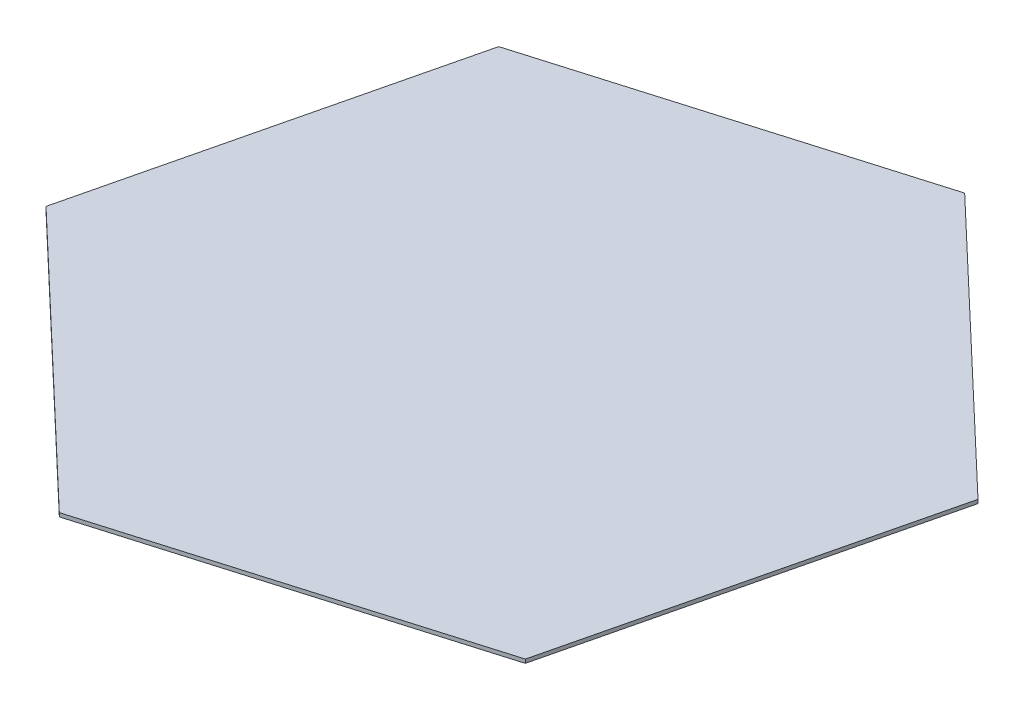
ISO-10303-21;
HEADER;
FILE_DESCRIPTION(('STEP AP214'),'2;1');
FILE_NAME('part.step','',(''),(''),'','','');
FILE_SCHEMA(('AUTOMOTIVE_DESIGN { 1 0 10303 214 1 1 1 1 }'));
ENDSEC;
DATA;
#1=APPLICATION_CONTEXT('core data for automotive mechanical design processes');
#2=APPLICATION_PROTOCOL_DEFINITION('international standard','automotive_design',2000,#1);
#3=PRODUCT_CONTEXT('',#1,'mechanical');
#4=PRODUCT('Part','Part','',(#3));
#5=PRODUCT_RELATED_PRODUCT_CATEGORY('part','',(#4));
#6=PRODUCT_DEFINITION_FORMATION('','',#4);
#7=PRODUCT_DEFINITION_CONTEXT('part definition',#1,'design');
#8=PRODUCT_DEFINITION('design','',#6,#7);
#9=PRODUCT_DEFINITION_SHAPE('','',#8);
#10=(LENGTH_UNIT() NAMED_UNIT(*) SI_UNIT(.MILLI.,.METRE.));
#11=(NAMED_UNIT(*) PLANE_ANGLE_UNIT() SI_UNIT($,.RADIAN.));
#12=(NAMED_UNIT(*) SI_UNIT($,.STERADIAN.) SOLID_ANGLE_UNIT());
#13=UNCERTAINTY_MEASURE_WITH_UNIT(LENGTH_MEASURE(1.E-05),#10,'distance_accuracy_value','');
#14=(GEOMETRIC_REPRESENTATION_CONTEXT(3) GLOBAL_UNCERTAINTY_ASSIGNED_CONTEXT((#13)) GLOBAL_UNIT_ASSIGNED_CONTEXT((#10,
#11,#12)) REPRESENTATION_CONTEXT('',''));
#15=CARTESIAN_POINT('',(0.,0.,0.));
#16=DIRECTION('',(0.,0.,1.));
#17=DIRECTION('',(1.,0.,0.));
#18=AXIS2_PLACEMENT_3D('',#15,#16,#17);
#19=CARTESIAN_POINT('',(-191.823582954893,2.,56.601351771379));
#20=DIRECTION('',(0.689117099990996,0.,-0.72465));
#21=DIRECTION('',(-0.72465,0.,-0.689117099990996));
#22=AXIS2_PLACEMENT_3D('',#19,#20,#21);
#23=PLANE('',#22);
#24=DIRECTION('',(0.72465,0.,0.689117099990996));
#25=VECTOR('',#24,1.);
#26=CARTESIAN_POINT('',(-191.823582954893,0.,56.601351771379));
#27=LINE('',#26,#25);
#28=CARTESIAN_POINT('',(-191.823582954893,0.,56.601351771379));
#29=VERTEX_POINT('',#28);
#30=CARTESIAN_POINT('',(-46.8935829548927,0.,194.424771769578));
#31=VERTEX_POINT('',#30);
#32=EDGE_CURVE('E128',#29,#31,#27,.T.);
#33=ORIENTED_EDGE('',*,*,#32,.T.);
#34=DIRECTION('',(0.,-1.,0.));
#35=VECTOR('',#34,1.);
#36=CARTESIAN_POINT('',(-46.8935829548927,2.,194.424771769578));
#37=LINE('',#36,#35);
#38=CARTESIAN_POINT('',(-46.8935829548927,2.,194.424771769578));
#39=VERTEX_POINT('',#38);
#40=EDGE_CURVE('E11',#39,#31,#37,.T.);
#41=ORIENTED_EDGE('',*,*,#40,.F.);
#42=DIRECTION('',(0.72465,0.,0.689117099990996));
#43=VECTOR('',#42,1.);
#44=CARTESIAN_POINT('',(-191.823582954893,2.,56.601351771379));
#45=LINE('',#44,#43);
#46=CARTESIAN_POINT('',(-191.823582954893,2.,56.601351771379));
#47=VERTEX_POINT('',#46);
#48=EDGE_CURVE('E144',#47,#39,#45,.T.);
#49=ORIENTED_EDGE('',*,*,#48,.F.);
#50=DIRECTION('',(0.,-1.,0.));
#51=VECTOR('',#50,1.);
#52=CARTESIAN_POINT('',(-191.823582954893,2.,56.601351771379));
#53=LINE('',#52,#51);
#54=EDGE_CURVE('E124',#47,#29,#53,.T.);
#55=ORIENTED_EDGE('',*,*,#54,.T.);
#56=EDGE_LOOP('',(#33,#41,#49,#55));
#57=FACE_BOUND('',#56,.T.);
#58=ADVANCED_FACE('F39',(#57),#23,.F.);
#59=CARTESIAN_POINT('',(-46.8935829548927,2.,194.424771769578));
#60=DIRECTION('',(-0.283006758856896,0.,-0.959117914774463));
#61=DIRECTION('',(-0.959117914774463,0.,0.283006758856896));
#62=AXIS2_PLACEMENT_3D('',#59,#60,#61);
#63=PLANE('',#62);
#64=DIRECTION('',(0.959117914774463,0.,-0.283006758856896));
#65=VECTOR('',#64,1.);
#66=CARTESIAN_POINT('',(-46.8935829548927,0.,194.424771769578));
#67=LINE('',#66,#65);
#68=CARTESIAN_POINT('',(144.93,0.,137.823419998199));
#69=VERTEX_POINT('',#68);
#70=EDGE_CURVE('E132',#31,#69,#67,.T.);
#71=ORIENTED_EDGE('',*,*,#70,.T.);
#72=DIRECTION('',(0.,-1.,0.));
#73=VECTOR('',#72,1.);
#74=CARTESIAN_POINT('',(144.93,2.,137.823419998199));
#75=LINE('',#74,#73);
#76=CARTESIAN_POINT('',(144.93,2.,137.823419998199));
#77=VERTEX_POINT('',#76);
#78=EDGE_CURVE('E48',#77,#69,#75,.T.);
#79=ORIENTED_EDGE('',*,*,#78,.F.);
#80=DIRECTION('',(0.959117914774463,0.,-0.283006758856896));
#81=VECTOR('',#80,1.);
#82=CARTESIAN_POINT('',(-46.8935829548927,2.,194.424771769578));
#83=LINE('',#82,#81);
#84=EDGE_CURVE('E93',#39,#77,#83,.T.);
#85=ORIENTED_EDGE('',*,*,#84,.F.);
#86=ORIENTED_EDGE('',*,*,#40,.T.);
#87=EDGE_LOOP('',(#71,#79,#85,#86));
#88=FACE_BOUND('',#87,.T.);
#89=ADVANCED_FACE('F172',(#88),#63,.F.);
#90=CARTESIAN_POINT('',(144.93,2.,137.823419998199));
#91=DIRECTION('',(-0.972123858847891,0.,-0.234467914774464));
#92=DIRECTION('',(-0.234467914774464,0.,0.972123858847891));
#93=AXIS2_PLACEMENT_3D('',#90,#91,#92);
#94=PLANE('',#93);
#95=DIRECTION('',(0.234467914774464,0.,-0.972123858847891));
#96=VECTOR('',#95,1.);
#97=CARTESIAN_POINT('',(144.93,0.,137.823419998199));
#98=LINE('',#97,#96);
#99=CARTESIAN_POINT('',(191.823582954893,0.,-56.6013517713791));
#100=VERTEX_POINT('',#99);
#101=EDGE_CURVE('E135',#69,#100,#98,.T.);
#102=ORIENTED_EDGE('',*,*,#101,.T.);
#103=DIRECTION('',(0.,-1.,0.));
#104=VECTOR('',#103,1.);
#105=CARTESIAN_POINT('',(191.823582954893,2.,-56.6013517713791));
#106=LINE('',#105,#104);
#107=CARTESIAN_POINT('',(191.823582954893,2.,-56.6013517713791));
#108=VERTEX_POINT('',#107);
#109=EDGE_CURVE('E117',#108,#100,#106,.T.);
#110=ORIENTED_EDGE('',*,*,#109,.F.);
#111=DIRECTION('',(0.234467914774464,0.,-0.972123858847891));
#112=VECTOR('',#111,1.);
#113=CARTESIAN_POINT('',(144.93,2.,137.823419998199));
#114=LINE('',#113,#112);
#115=EDGE_CURVE('E106',#77,#108,#114,.T.);
#116=ORIENTED_EDGE('',*,*,#115,.F.);
#117=ORIENTED_EDGE('',*,*,#78,.T.);
#118=EDGE_LOOP('',(#102,#110,#116,#117));
#119=FACE_BOUND('',#118,.T.);
#120=ADVANCED_FACE('F154',(#119),#94,.F.);
#121=CARTESIAN_POINT('',(191.823582954893,2.,-56.6013517713791));
#122=DIRECTION('',(-0.689117099990996,0.,0.72465));
#123=DIRECTION('',(0.72465,0.,0.689117099990996));
#124=AXIS2_PLACEMENT_3D('',#121,#122,#123);
#125=PLANE('',#124);
#126=DIRECTION('',(-0.72465,0.,-0.689117099990996));
#127=VECTOR('',#126,1.);
#128=CARTESIAN_POINT('',(191.823582954893,0.,-56.6013517713791));
#129=LINE('',#128,#127);
#130=CARTESIAN_POINT('',(46.8935829548927,0.,-194.424771769578));
#131=VERTEX_POINT('',#130);
#132=EDGE_CURVE('E115',#100,#131,#129,.T.);
#133=ORIENTED_EDGE('',*,*,#132,.T.);
#134=DIRECTION('',(0.,-1.,0.));
#135=VECTOR('',#134,1.);
#136=CARTESIAN_POINT('',(46.8935829548927,2.,-194.424771769578));
#137=LINE('',#136,#135);
#138=CARTESIAN_POINT('',(46.8935829548927,2.,-194.424771769578));
#139=VERTEX_POINT('',#138);
#140=EDGE_CURVE('E112',#139,#131,#137,.T.);
#141=ORIENTED_EDGE('',*,*,#140,.F.);
#142=DIRECTION('',(-0.72465,0.,-0.689117099990996));
#143=VECTOR('',#142,1.);
#144=CARTESIAN_POINT('',(191.823582954893,2.,-56.6013517713791));
#145=LINE('',#144,#143);
#146=EDGE_CURVE('E100',#108,#139,#145,.T.);
#147=ORIENTED_EDGE('',*,*,#146,.F.);
#148=ORIENTED_EDGE('',*,*,#109,.T.);
#149=EDGE_LOOP('',(#133,#141,#147,#148));
#150=FACE_BOUND('',#149,.T.);
#151=ADVANCED_FACE('F113',(#150),#125,.F.);
#152=CARTESIAN_POINT('',(46.8935829548927,2.,-194.424771769578));
#153=DIRECTION('',(0.283006758856896,0.,0.959117914774463));
#154=DIRECTION('',(0.959117914774463,0.,-0.283006758856896));
#155=AXIS2_PLACEMENT_3D('',#152,#153,#154);
#156=PLANE('',#155);
#157=DIRECTION('',(-0.959117914774463,0.,0.283006758856896));
#158=VECTOR('',#157,1.);
#159=CARTESIAN_POINT('',(46.8935829548927,0.,-194.424771769578));
#160=LINE('',#159,#158);
#161=CARTESIAN_POINT('',(-144.93,0.,-137.823419998199));
#162=VERTEX_POINT('',#161);
#163=EDGE_CURVE('E79',#131,#162,#160,.T.);
#164=ORIENTED_EDGE('',*,*,#163,.T.);
#165=DIRECTION('',(0.,-1.,0.));
#166=VECTOR('',#165,1.);
#167=CARTESIAN_POINT('',(-144.93,2.,-137.823419998199));
#168=LINE('',#167,#166);
#169=CARTESIAN_POINT('',(-144.93,2.,-137.823419998199));
#170=VERTEX_POINT('',#169);
#171=EDGE_CURVE('E118',#170,#162,#168,.T.);
#172=ORIENTED_EDGE('',*,*,#171,.F.);
#173=DIRECTION('',(-0.959117914774463,0.,0.283006758856896));
#174=VECTOR('',#173,1.);
#175=CARTESIAN_POINT('',(46.8935829548927,2.,-194.424771769578));
#176=LINE('',#175,#174);
#177=EDGE_CURVE('E104',#139,#170,#176,.T.);
#178=ORIENTED_EDGE('',*,*,#177,.F.);
#179=ORIENTED_EDGE('',*,*,#140,.T.);
#180=EDGE_LOOP('',(#164,#172,#178,#179));
#181=FACE_BOUND('',#180,.T.);
#182=ADVANCED_FACE('F120',(#181),#156,.F.);
#183=CARTESIAN_POINT('',(-144.93,2.,-137.823419998199));
#184=DIRECTION('',(0.972123858847891,0.,0.234467914774464));
#185=DIRECTION('',(0.234467914774464,0.,-0.972123858847891));
#186=AXIS2_PLACEMENT_3D('',#183,#184,#185);
#187=PLANE('',#186);
#188=DIRECTION('',(-0.234467914774464,0.,0.972123858847891));
#189=VECTOR('',#188,1.);
#190=CARTESIAN_POINT('',(-144.93,0.,-137.823419998199));
#191=LINE('',#190,#189);
#192=EDGE_CURVE('E85',#162,#29,#191,.T.);
#193=ORIENTED_EDGE('',*,*,#192,.T.);
#194=ORIENTED_EDGE('',*,*,#54,.F.);
#195=DIRECTION('',(-0.234467914774464,0.,0.972123858847891));
#196=VECTOR('',#195,1.);
#197=CARTESIAN_POINT('',(-144.93,2.,-137.823419998199));
#198=LINE('',#197,#196);
#199=EDGE_CURVE('E56',#170,#47,#198,.T.);
#200=ORIENTED_EDGE('',*,*,#199,.F.);
#201=ORIENTED_EDGE('',*,*,#171,.T.);
#202=EDGE_LOOP('',(#193,#194,#200,#201));
#203=FACE_BOUND('',#202,.T.);
#204=ADVANCED_FACE('F161',(#203),#187,.F.);
#205=CARTESIAN_POINT('',(0.,2.,0.));
#206=DIRECTION('',(0.,1.,0.));
#207=DIRECTION('',(0.,0.,1.));
#208=AXIS2_PLACEMENT_3D('',#205,#206,#207);
#209=PLANE('',#208);
#210=ORIENTED_EDGE('',*,*,#48,.T.);
#211=ORIENTED_EDGE('',*,*,#84,.T.);
#212=ORIENTED_EDGE('',*,*,#115,.T.);
#213=ORIENTED_EDGE('',*,*,#146,.T.);
#214=ORIENTED_EDGE('',*,*,#177,.T.);
#215=ORIENTED_EDGE('',*,*,#199,.T.);
#216=EDGE_LOOP('',(#210,#211,#212,#213,#214,#215));
#217=FACE_BOUND('',#216,.T.);
#218=ADVANCED_FACE('F102',(#217),#209,.T.);
#219=CARTESIAN_POINT('',(0.,0.,0.));
#220=DIRECTION('',(0.,1.,0.));
#221=DIRECTION('',(0.,0.,1.));
#222=AXIS2_PLACEMENT_3D('',#219,#220,#221);
#223=PLANE('',#222);
#224=ORIENTED_EDGE('',*,*,#32,.F.);
#225=ORIENTED_EDGE('',*,*,#192,.F.);
#226=ORIENTED_EDGE('',*,*,#163,.F.);
#227=ORIENTED_EDGE('',*,*,#132,.F.);
#228=ORIENTED_EDGE('',*,*,#101,.F.);
#229=ORIENTED_EDGE('',*,*,#70,.F.);
#230=EDGE_LOOP('',(#224,#225,#226,#227,#228,#229));
#231=FACE_BOUND('',#230,.T.);
#232=ADVANCED_FACE('F157',(#231),#223,.F.);
#233=CLOSED_SHELL('',(#58,#89,#120,#151,#182,#204,#218,#232));
#234=MANIFOLD_SOLID_BREP('B2',#233);
#235=ADVANCED_BREP_SHAPE_REPRESENTATION('',(#18,#234),#14);
#236=SHAPE_DEFINITION_REPRESENTATION(#9,#235);
ENDSEC;
END-ISO-10303-21;
